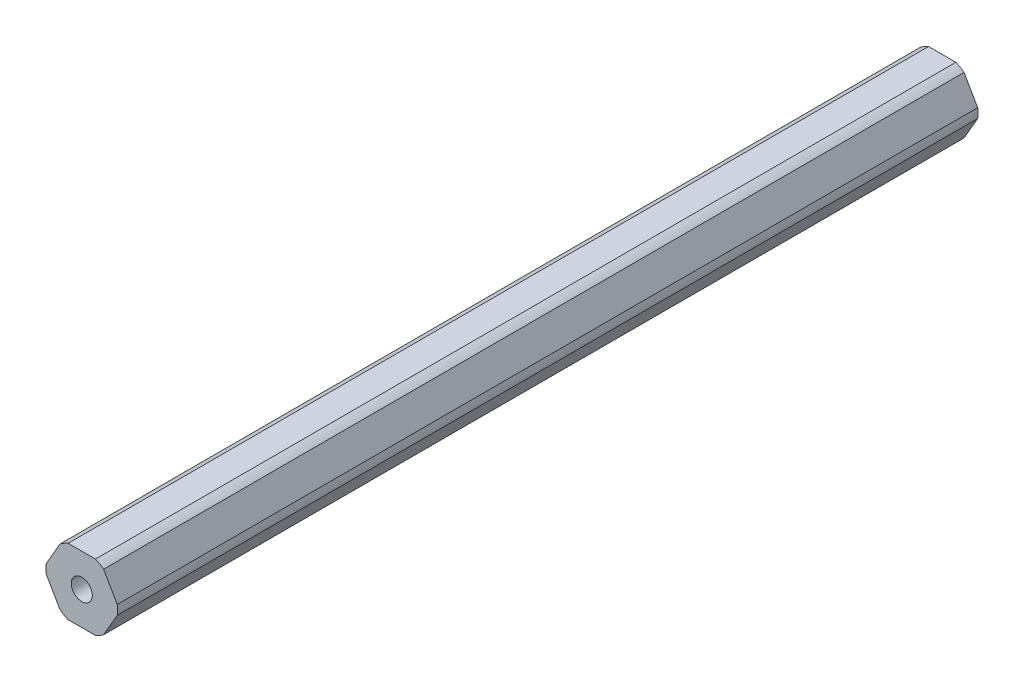
ISO-10303-21;
HEADER;
FILE_DESCRIPTION(('STEP AP214'),'2;1');
FILE_NAME('part.step','',(''),(''),'','','');
FILE_SCHEMA(('AUTOMOTIVE_DESIGN { 1 0 10303 214 1 1 1 1 }'));
ENDSEC;
DATA;
#1=APPLICATION_CONTEXT('core data for automotive mechanical design processes');
#2=APPLICATION_PROTOCOL_DEFINITION('international standard','automotive_design',2000,#1);
#3=PRODUCT_CONTEXT('',#1,'mechanical');
#4=PRODUCT('Part','Part','',(#3));
#5=PRODUCT_RELATED_PRODUCT_CATEGORY('part','',(#4));
#6=PRODUCT_DEFINITION_FORMATION('','',#4);
#7=PRODUCT_DEFINITION_CONTEXT('part definition',#1,'design');
#8=PRODUCT_DEFINITION('design','',#6,#7);
#9=PRODUCT_DEFINITION_SHAPE('','',#8);
#10=(LENGTH_UNIT() NAMED_UNIT(*) SI_UNIT(.MILLI.,.METRE.));
#11=(NAMED_UNIT(*) PLANE_ANGLE_UNIT() SI_UNIT($,.RADIAN.));
#12=(NAMED_UNIT(*) SI_UNIT($,.STERADIAN.) SOLID_ANGLE_UNIT());
#13=UNCERTAINTY_MEASURE_WITH_UNIT(LENGTH_MEASURE(1.E-05),#10,'distance_accuracy_value','');
#14=(GEOMETRIC_REPRESENTATION_CONTEXT(3) GLOBAL_UNCERTAINTY_ASSIGNED_CONTEXT((#13)) GLOBAL_UNIT_ASSIGNED_CONTEXT((#10,
#11,#12)) REPRESENTATION_CONTEXT('',''));
#15=CARTESIAN_POINT('',(0.,0.,0.));
#16=DIRECTION('',(0.,0.,1.));
#17=DIRECTION('',(1.,0.,0.));
#18=AXIS2_PLACEMENT_3D('',#15,#16,#17);
#19=CARTESIAN_POINT('',(-5.49926131403119,3.175,165.1));
#20=DIRECTION('',(0.866025403784438,-0.5,0.));
#21=DIRECTION('',(0.5,0.866025403784439,0.));
#22=AXIS2_PLACEMENT_3D('',#19,#20,#21);
#23=PLANE('',#22);
#24=DIRECTION('',(-0.5,-0.866025403784439,0.));
#25=VECTOR('',#24,1.);
#26=CARTESIAN_POINT('',(-5.49926131403119,3.175,0.));
#27=LINE('',#26,#25);
#28=CARTESIAN_POINT('',(-4.18739065634423,5.4472266320726,0.));
#29=VERTEX_POINT('',#28);
#30=CARTESIAN_POINT('',(-6.81113197171814,0.902773367927401,0.));
#31=VERTEX_POINT('',#30);
#32=EDGE_CURVE('E176',#29,#31,#27,.T.);
#33=ORIENTED_EDGE('',*,*,#32,.T.);
#34=DIRECTION('',(0.,0.,-1.));
#35=VECTOR('',#34,1.);
#36=CARTESIAN_POINT('',(-6.81113197171814,0.902773367927401,165.1));
#37=LINE('',#36,#35);
#38=CARTESIAN_POINT('',(-6.81113197171814,0.902773367927401,165.1));
#39=VERTEX_POINT('',#38);
#40=EDGE_CURVE('E11',#39,#31,#37,.T.);
#41=ORIENTED_EDGE('',*,*,#40,.F.);
#42=DIRECTION('',(-0.5,-0.866025403784439,0.));
#43=VECTOR('',#42,1.);
#44=CARTESIAN_POINT('',(-5.49926131403119,3.175,165.1));
#45=LINE('',#44,#43);
#46=CARTESIAN_POINT('',(-4.18739065634423,5.4472266320726,165.1));
#47=VERTEX_POINT('',#46);
#48=EDGE_CURVE('E290',#47,#39,#45,.T.);
#49=ORIENTED_EDGE('',*,*,#48,.F.);
#50=DIRECTION('',(0.,0.,-1.));
#51=VECTOR('',#50,1.);
#52=CARTESIAN_POINT('',(-4.18739065634423,5.4472266320726,165.1));
#53=LINE('',#52,#51);
#54=EDGE_CURVE('E168',#47,#29,#53,.T.);
#55=ORIENTED_EDGE('',*,*,#54,.T.);
#56=EDGE_LOOP('',(#33,#41,#49,#55));
#57=FACE_BOUND('',#56,.T.);
#58=ADVANCED_FACE('F45',(#57),#23,.F.);
#59=CARTESIAN_POINT('',(0.,0.,165.1));
#60=DIRECTION('',(0.,0.,-1.));
#61=DIRECTION('',(-1.,0.,0.));
#62=AXIS2_PLACEMENT_3D('',#59,#60,#61);
#63=CYLINDRICAL_SURFACE('',#62,6.8707);
#64=CARTESIAN_POINT('',(0.,0.,0.));
#65=DIRECTION('',(0.,0.,1.));
#66=DIRECTION('',(1.,0.,0.));
#67=AXIS2_PLACEMENT_3D('',#64,#65,#66);
#68=CIRCLE('',#67,6.8707);
#69=CARTESIAN_POINT('',(-6.81113197171814,-0.902773367927395,0.));
#70=VERTEX_POINT('',#69);
#71=EDGE_CURVE('E180',#31,#70,#68,.T.);
#72=ORIENTED_EDGE('',*,*,#71,.T.);
#73=DIRECTION('',(0.,0.,-1.));
#74=VECTOR('',#73,1.);
#75=CARTESIAN_POINT('',(-6.81113197171814,-0.902773367927395,165.1));
#76=LINE('',#75,#74);
#77=CARTESIAN_POINT('',(-6.81113197171814,-0.902773367927395,165.1));
#78=VERTEX_POINT('',#77);
#79=EDGE_CURVE('E55',#78,#70,#76,.T.);
#80=ORIENTED_EDGE('',*,*,#79,.F.);
#81=CARTESIAN_POINT('',(0.,0.,165.1));
#82=DIRECTION('',(0.,0.,1.));
#83=DIRECTION('',(1.,0.,0.));
#84=AXIS2_PLACEMENT_3D('',#81,#82,#83);
#85=CIRCLE('',#84,6.8707);
#86=EDGE_CURVE('E118',#39,#78,#85,.T.);
#87=ORIENTED_EDGE('',*,*,#86,.F.);
#88=ORIENTED_EDGE('',*,*,#40,.T.);
#89=EDGE_LOOP('',(#72,#80,#87,#88));
#90=FACE_BOUND('',#89,.T.);
#91=ADVANCED_FACE('F299',(#90),#63,.T.);
#92=CARTESIAN_POINT('',(-5.49926131403119,-3.175,165.1));
#93=DIRECTION('',(0.866025403784439,0.5,0.));
#94=DIRECTION('',(-0.5,0.866025403784439,0.));
#95=AXIS2_PLACEMENT_3D('',#92,#93,#94);
#96=PLANE('',#95);
#97=DIRECTION('',(0.5,-0.866025403784439,0.));
#98=VECTOR('',#97,1.);
#99=CARTESIAN_POINT('',(-5.49926131403119,-3.175,0.));
#100=LINE('',#99,#98);
#101=CARTESIAN_POINT('',(-4.18739065634423,-5.4472266320726,0.));
#102=VERTEX_POINT('',#101);
#103=EDGE_CURVE('E183',#70,#102,#100,.T.);
#104=ORIENTED_EDGE('',*,*,#103,.T.);
#105=DIRECTION('',(0.,0.,-1.));
#106=VECTOR('',#105,1.);
#107=CARTESIAN_POINT('',(-4.18739065634423,-5.4472266320726,165.1));
#108=LINE('',#107,#106);
#109=CARTESIAN_POINT('',(-4.18739065634423,-5.4472266320726,165.1));
#110=VERTEX_POINT('',#109);
#111=EDGE_CURVE('E235',#110,#102,#108,.T.);
#112=ORIENTED_EDGE('',*,*,#111,.F.);
#113=DIRECTION('',(0.5,-0.866025403784439,0.));
#114=VECTOR('',#113,1.);
#115=CARTESIAN_POINT('',(-5.49926131403119,-3.175,165.1));
#116=LINE('',#115,#114);
#117=EDGE_CURVE('E245',#78,#110,#116,.T.);
#118=ORIENTED_EDGE('',*,*,#117,.F.);
#119=ORIENTED_EDGE('',*,*,#79,.T.);
#120=EDGE_LOOP('',(#104,#112,#118,#119));
#121=FACE_BOUND('',#120,.T.);
#122=ADVANCED_FACE('F243',(#121),#96,.F.);
#123=CARTESIAN_POINT('',(0.,0.,165.1));
#124=DIRECTION('',(0.,0.,-1.));
#125=DIRECTION('',(-1.,0.,0.));
#126=AXIS2_PLACEMENT_3D('',#123,#124,#125);
#127=CYLINDRICAL_SURFACE('',#126,6.8707);
#128=CARTESIAN_POINT('',(0.,0.,0.));
#129=DIRECTION('',(0.,0.,1.));
#130=DIRECTION('',(1.,0.,0.));
#131=AXIS2_PLACEMENT_3D('',#128,#129,#130);
#132=CIRCLE('',#131,6.8707);
#133=CARTESIAN_POINT('',(-2.62374131537391,-6.35,0.));
#134=VERTEX_POINT('',#133);
#135=EDGE_CURVE('E186',#102,#134,#132,.T.);
#136=ORIENTED_EDGE('',*,*,#135,.T.);
#137=DIRECTION('',(0.,0.,-1.));
#138=VECTOR('',#137,1.);
#139=CARTESIAN_POINT('',(-2.62374131537391,-6.35,165.1));
#140=LINE('',#139,#138);
#141=CARTESIAN_POINT('',(-2.62374131537391,-6.35,165.1));
#142=VERTEX_POINT('',#141);
#143=EDGE_CURVE('E231',#142,#134,#140,.T.);
#144=ORIENTED_EDGE('',*,*,#143,.F.);
#145=CARTESIAN_POINT('',(0.,0.,165.1));
#146=DIRECTION('',(0.,0.,1.));
#147=DIRECTION('',(1.,0.,0.));
#148=AXIS2_PLACEMENT_3D('',#145,#146,#147);
#149=CIRCLE('',#148,6.8707);
#150=EDGE_CURVE('E264',#110,#142,#149,.T.);
#151=ORIENTED_EDGE('',*,*,#150,.F.);
#152=ORIENTED_EDGE('',*,*,#111,.T.);
#153=EDGE_LOOP('',(#136,#144,#151,#152));
#154=FACE_BOUND('',#153,.T.);
#155=ADVANCED_FACE('F254',(#154),#127,.T.);
#156=CARTESIAN_POINT('',(0.,-6.35,165.1));
#157=DIRECTION('',(0.,1.,0.));
#158=DIRECTION('',(0.,0.,1.));
#159=AXIS2_PLACEMENT_3D('',#156,#157,#158);
#160=PLANE('',#159);
#161=DIRECTION('',(1.,0.,0.));
#162=VECTOR('',#161,1.);
#163=CARTESIAN_POINT('',(0.,-6.35,0.));
#164=LINE('',#163,#162);
#165=CARTESIAN_POINT('',(2.62374131537391,-6.35,0.));
#166=VERTEX_POINT('',#165);
#167=EDGE_CURVE('E189',#134,#166,#164,.T.);
#168=ORIENTED_EDGE('',*,*,#167,.T.);
#169=DIRECTION('',(0.,0.,-1.));
#170=VECTOR('',#169,1.);
#171=CARTESIAN_POINT('',(2.62374131537391,-6.35,165.1));
#172=LINE('',#171,#170);
#173=CARTESIAN_POINT('',(2.62374131537391,-6.35,165.1));
#174=VERTEX_POINT('',#173);
#175=EDGE_CURVE('E227',#174,#166,#172,.T.);
#176=ORIENTED_EDGE('',*,*,#175,.F.);
#177=DIRECTION('',(1.,0.,0.));
#178=VECTOR('',#177,1.);
#179=CARTESIAN_POINT('',(0.,-6.35,165.1));
#180=LINE('',#179,#178);
#181=EDGE_CURVE('E260',#142,#174,#180,.T.);
#182=ORIENTED_EDGE('',*,*,#181,.F.);
#183=ORIENTED_EDGE('',*,*,#143,.T.);
#184=EDGE_LOOP('',(#168,#176,#182,#183));
#185=FACE_BOUND('',#184,.T.);
#186=ADVANCED_FACE('F258',(#185),#160,.F.);
#187=CARTESIAN_POINT('',(0.,0.,165.1));
#188=DIRECTION('',(0.,0.,-1.));
#189=DIRECTION('',(-1.,0.,0.));
#190=AXIS2_PLACEMENT_3D('',#187,#188,#189);
#191=CYLINDRICAL_SURFACE('',#190,6.8707);
#192=CARTESIAN_POINT('',(0.,0.,0.));
#193=DIRECTION('',(0.,0.,1.));
#194=DIRECTION('',(1.,0.,0.));
#195=AXIS2_PLACEMENT_3D('',#192,#193,#194);
#196=CIRCLE('',#195,6.8707);
#197=CARTESIAN_POINT('',(4.18739065634422,-5.44722663207261,0.));
#198=VERTEX_POINT('',#197);
#199=EDGE_CURVE('E192',#166,#198,#196,.T.);
#200=ORIENTED_EDGE('',*,*,#199,.T.);
#201=DIRECTION('',(0.,0.,-1.));
#202=VECTOR('',#201,1.);
#203=CARTESIAN_POINT('',(4.18739065634422,-5.44722663207261,165.1));
#204=LINE('',#203,#202);
#205=CARTESIAN_POINT('',(4.18739065634422,-5.44722663207261,165.1));
#206=VERTEX_POINT('',#205);
#207=EDGE_CURVE('E223',#206,#198,#204,.T.);
#208=ORIENTED_EDGE('',*,*,#207,.F.);
#209=CARTESIAN_POINT('',(0.,0.,165.1));
#210=DIRECTION('',(0.,0.,1.));
#211=DIRECTION('',(1.,0.,0.));
#212=AXIS2_PLACEMENT_3D('',#209,#210,#211);
#213=CIRCLE('',#212,6.8707);
#214=EDGE_CURVE('E263',#174,#206,#213,.T.);
#215=ORIENTED_EDGE('',*,*,#214,.F.);
#216=ORIENTED_EDGE('',*,*,#175,.T.);
#217=EDGE_LOOP('',(#200,#208,#215,#216));
#218=FACE_BOUND('',#217,.T.);
#219=ADVANCED_FACE('F312',(#218),#191,.T.);
#220=CARTESIAN_POINT('',(5.49926131403118,-3.175,165.1));
#221=DIRECTION('',(-0.866025403784439,0.5,0.));
#222=DIRECTION('',(-0.5,-0.866025403784439,0.));
#223=AXIS2_PLACEMENT_3D('',#220,#221,#222);
#224=PLANE('',#223);
#225=DIRECTION('',(0.5,0.866025403784439,0.));
#226=VECTOR('',#225,1.);
#227=CARTESIAN_POINT('',(5.49926131403118,-3.175,0.));
#228=LINE('',#227,#226);
#229=CARTESIAN_POINT('',(6.81113197171814,-0.902773367927386,0.));
#230=VERTEX_POINT('',#229);
#231=EDGE_CURVE('E195',#198,#230,#228,.T.);
#232=ORIENTED_EDGE('',*,*,#231,.T.);
#233=DIRECTION('',(0.,0.,-1.));
#234=VECTOR('',#233,1.);
#235=CARTESIAN_POINT('',(6.81113197171814,-0.902773367927386,165.1));
#236=LINE('',#235,#234);
#237=CARTESIAN_POINT('',(6.81113197171814,-0.902773367927386,165.1));
#238=VERTEX_POINT('',#237);
#239=EDGE_CURVE('E219',#238,#230,#236,.T.);
#240=ORIENTED_EDGE('',*,*,#239,.F.);
#241=DIRECTION('',(0.5,0.866025403784439,0.));
#242=VECTOR('',#241,1.);
#243=CARTESIAN_POINT('',(5.49926131403118,-3.175,165.1));
#244=LINE('',#243,#242);
#245=EDGE_CURVE('E268',#206,#238,#244,.T.);
#246=ORIENTED_EDGE('',*,*,#245,.F.);
#247=ORIENTED_EDGE('',*,*,#207,.T.);
#248=EDGE_LOOP('',(#232,#240,#246,#247));
#249=FACE_BOUND('',#248,.T.);
#250=ADVANCED_FACE('F315',(#249),#224,.F.);
#251=CARTESIAN_POINT('',(0.,0.,165.1));
#252=DIRECTION('',(0.,0.,-1.));
#253=DIRECTION('',(-1.,0.,0.));
#254=AXIS2_PLACEMENT_3D('',#251,#252,#253);
#255=CYLINDRICAL_SURFACE('',#254,6.8707);
#256=CARTESIAN_POINT('',(0.,0.,0.));
#257=DIRECTION('',(0.,0.,1.));
#258=DIRECTION('',(1.,0.,0.));
#259=AXIS2_PLACEMENT_3D('',#256,#257,#258);
#260=CIRCLE('',#259,6.8707);
#261=CARTESIAN_POINT('',(6.81113197171814,0.902773367927401,0.));
#262=VERTEX_POINT('',#261);
#263=EDGE_CURVE('E198',#230,#262,#260,.T.);
#264=ORIENTED_EDGE('',*,*,#263,.T.);
#265=DIRECTION('',(0.,0.,-1.));
#266=VECTOR('',#265,1.);
#267=CARTESIAN_POINT('',(6.81113197171814,0.902773367927401,165.1));
#268=LINE('',#267,#266);
#269=CARTESIAN_POINT('',(6.81113197171814,0.902773367927401,165.1));
#270=VERTEX_POINT('',#269);
#271=EDGE_CURVE('E215',#270,#262,#268,.T.);
#272=ORIENTED_EDGE('',*,*,#271,.F.);
#273=CARTESIAN_POINT('',(0.,0.,165.1));
#274=DIRECTION('',(0.,0.,1.));
#275=DIRECTION('',(1.,0.,0.));
#276=AXIS2_PLACEMENT_3D('',#273,#274,#275);
#277=CIRCLE('',#276,6.8707);
#278=EDGE_CURVE('E155',#238,#270,#277,.T.);
#279=ORIENTED_EDGE('',*,*,#278,.F.);
#280=ORIENTED_EDGE('',*,*,#239,.T.);
#281=EDGE_LOOP('',(#264,#272,#279,#280));
#282=FACE_BOUND('',#281,.T.);
#283=ADVANCED_FACE('F281',(#282),#255,.T.);
#284=CARTESIAN_POINT('',(5.49926131403119,3.175,165.1));
#285=DIRECTION('',(-0.866025403784438,-0.5,0.));
#286=DIRECTION('',(0.5,-0.866025403784439,0.));
#287=AXIS2_PLACEMENT_3D('',#284,#285,#286);
#288=PLANE('',#287);
#289=DIRECTION('',(-0.5,0.866025403784439,0.));
#290=VECTOR('',#289,1.);
#291=CARTESIAN_POINT('',(5.49926131403119,3.175,0.));
#292=LINE('',#291,#290);
#293=CARTESIAN_POINT('',(4.18739065634423,5.4472266320726,0.));
#294=VERTEX_POINT('',#293);
#295=EDGE_CURVE('E201',#262,#294,#292,.T.);
#296=ORIENTED_EDGE('',*,*,#295,.T.);
#297=DIRECTION('',(0.,0.,-1.));
#298=VECTOR('',#297,1.);
#299=CARTESIAN_POINT('',(4.18739065634423,5.4472266320726,165.1));
#300=LINE('',#299,#298);
#301=CARTESIAN_POINT('',(4.18739065634423,5.4472266320726,165.1));
#302=VERTEX_POINT('',#301);
#303=EDGE_CURVE('E161',#302,#294,#300,.T.);
#304=ORIENTED_EDGE('',*,*,#303,.F.);
#305=DIRECTION('',(-0.5,0.866025403784439,0.));
#306=VECTOR('',#305,1.);
#307=CARTESIAN_POINT('',(5.49926131403119,3.175,165.1));
#308=LINE('',#307,#306);
#309=EDGE_CURVE('E149',#270,#302,#308,.T.);
#310=ORIENTED_EDGE('',*,*,#309,.F.);
#311=ORIENTED_EDGE('',*,*,#271,.T.);
#312=EDGE_LOOP('',(#296,#304,#310,#311));
#313=FACE_BOUND('',#312,.T.);
#314=ADVANCED_FACE('F285',(#313),#288,.F.);
#315=CARTESIAN_POINT('',(2.62374131537391,6.35,0.));
#316=VERTEX_POINT('',#315);
#317=EDGE_CURVE('E159',#294,#316,#260,.T.);
#318=ORIENTED_EDGE('',*,*,#317,.T.);
#319=DIRECTION('',(0.,0.,-1.));
#320=VECTOR('',#319,1.);
#321=CARTESIAN_POINT('',(2.62374131537391,6.35,165.1));
#322=LINE('',#321,#320);
#323=CARTESIAN_POINT('',(2.62374131537391,6.35,165.1));
#324=VERTEX_POINT('',#323);
#325=EDGE_CURVE('E156',#324,#316,#322,.T.);
#326=ORIENTED_EDGE('',*,*,#325,.F.);
#327=EDGE_CURVE('E143',#302,#324,#277,.T.);
#328=ORIENTED_EDGE('',*,*,#327,.F.);
#329=ORIENTED_EDGE('',*,*,#303,.T.);
#330=EDGE_LOOP('',(#318,#326,#328,#329));
#331=FACE_BOUND('',#330,.T.);
#332=ADVANCED_FACE('F157',(#331),#255,.T.);
#333=CARTESIAN_POINT('',(0.,6.35,165.1));
#334=DIRECTION('',(0.,-1.,0.));
#335=DIRECTION('',(0.,0.,-1.));
#336=AXIS2_PLACEMENT_3D('',#333,#334,#335);
#337=PLANE('',#336);
#338=DIRECTION('',(-1.,0.,0.));
#339=VECTOR('',#338,1.);
#340=CARTESIAN_POINT('',(0.,6.35,0.));
#341=LINE('',#340,#339);
#342=CARTESIAN_POINT('',(-2.62374131537391,6.35,0.));
#343=VERTEX_POINT('',#342);
#344=EDGE_CURVE('E104',#316,#343,#341,.T.);
#345=ORIENTED_EDGE('',*,*,#344,.T.);
#346=DIRECTION('',(0.,0.,-1.));
#347=VECTOR('',#346,1.);
#348=CARTESIAN_POINT('',(-2.62374131537391,6.35,165.1));
#349=LINE('',#348,#347);
#350=CARTESIAN_POINT('',(-2.62374131537391,6.35,165.1));
#351=VERTEX_POINT('',#350);
#352=EDGE_CURVE('E162',#351,#343,#349,.T.);
#353=ORIENTED_EDGE('',*,*,#352,.F.);
#354=DIRECTION('',(-1.,0.,0.));
#355=VECTOR('',#354,1.);
#356=CARTESIAN_POINT('',(0.,6.35,165.1));
#357=LINE('',#356,#355);
#358=EDGE_CURVE('E147',#324,#351,#357,.T.);
#359=ORIENTED_EDGE('',*,*,#358,.F.);
#360=ORIENTED_EDGE('',*,*,#325,.T.);
#361=EDGE_LOOP('',(#345,#353,#359,#360));
#362=FACE_BOUND('',#361,.T.);
#363=ADVANCED_FACE('F164',(#362),#337,.F.);
#364=CARTESIAN_POINT('',(0.,0.,165.1));
#365=DIRECTION('',(0.,0.,-1.));
#366=DIRECTION('',(-1.,0.,0.));
#367=AXIS2_PLACEMENT_3D('',#364,#365,#366);
#368=CYLINDRICAL_SURFACE('',#367,2.0193);
#369=CARTESIAN_POINT('',(0.,0.,165.1));
#370=DIRECTION('',(0.,0.,1.));
#371=DIRECTION('',(1.,0.,0.));
#372=AXIS2_PLACEMENT_3D('',#369,#370,#371);
#373=CIRCLE('',#372,2.0193);
#374=CARTESIAN_POINT('',(2.0193,0.,165.1));
#375=VERTEX_POINT('',#374);
#376=EDGE_CURVE('E208',#375,#375,#373,.T.);
#377=ORIENTED_EDGE('',*,*,#376,.T.);
#378=EDGE_LOOP('',(#377));
#379=FACE_BOUND('',#378,.T.);
#380=CARTESIAN_POINT('',(0.,0.,0.));
#381=DIRECTION('',(0.,0.,1.));
#382=DIRECTION('',(1.,0.,0.));
#383=AXIS2_PLACEMENT_3D('',#380,#381,#382);
#384=CIRCLE('',#383,2.0193);
#385=CARTESIAN_POINT('',(2.0193,0.,0.));
#386=VERTEX_POINT('',#385);
#387=EDGE_CURVE('E172',#386,#386,#384,.T.);
#388=ORIENTED_EDGE('',*,*,#387,.F.);
#389=EDGE_LOOP('',(#388));
#390=FACE_BOUND('',#389,.T.);
#391=ADVANCED_FACE('F47',(#379,#390),#368,.F.);
#392=CARTESIAN_POINT('',(0.,0.,165.1));
#393=DIRECTION('',(0.,0.,-1.));
#394=DIRECTION('',(-1.,0.,0.));
#395=AXIS2_PLACEMENT_3D('',#392,#393,#394);
#396=CYLINDRICAL_SURFACE('',#395,6.8707);
#397=CARTESIAN_POINT('',(0.,0.,0.));
#398=DIRECTION('',(0.,0.,1.));
#399=DIRECTION('',(1.,0.,0.));
#400=AXIS2_PLACEMENT_3D('',#397,#398,#399);
#401=CIRCLE('',#400,6.8707);
#402=EDGE_CURVE('E110',#343,#29,#401,.T.);
#403=ORIENTED_EDGE('',*,*,#402,.T.);
#404=ORIENTED_EDGE('',*,*,#54,.F.);
#405=CARTESIAN_POINT('',(0.,0.,165.1));
#406=DIRECTION('',(0.,0.,1.));
#407=DIRECTION('',(1.,0.,0.));
#408=AXIS2_PLACEMENT_3D('',#405,#406,#407);
#409=CIRCLE('',#408,6.8707);
#410=EDGE_CURVE('E63',#351,#47,#409,.T.);
#411=ORIENTED_EDGE('',*,*,#410,.F.);
#412=ORIENTED_EDGE('',*,*,#352,.T.);
#413=EDGE_LOOP('',(#403,#404,#411,#412));
#414=FACE_BOUND('',#413,.T.);
#415=ADVANCED_FACE('F326',(#414),#396,.T.);
#416=CARTESIAN_POINT('',(0.,0.,165.1));
#417=DIRECTION('',(0.,0.,1.));
#418=DIRECTION('',(1.,0.,0.));
#419=AXIS2_PLACEMENT_3D('',#416,#417,#418);
#420=PLANE('',#419);
#421=ORIENTED_EDGE('',*,*,#376,.F.);
#422=EDGE_LOOP('',(#421));
#423=FACE_BOUND('',#422,.T.);
#424=ORIENTED_EDGE('',*,*,#48,.T.);
#425=ORIENTED_EDGE('',*,*,#86,.T.);
#426=ORIENTED_EDGE('',*,*,#117,.T.);
#427=ORIENTED_EDGE('',*,*,#150,.T.);
#428=ORIENTED_EDGE('',*,*,#181,.T.);
#429=ORIENTED_EDGE('',*,*,#214,.T.);
#430=ORIENTED_EDGE('',*,*,#245,.T.);
#431=ORIENTED_EDGE('',*,*,#278,.T.);
#432=ORIENTED_EDGE('',*,*,#309,.T.);
#433=ORIENTED_EDGE('',*,*,#327,.T.);
#434=ORIENTED_EDGE('',*,*,#358,.T.);
#435=ORIENTED_EDGE('',*,*,#410,.T.);
#436=EDGE_LOOP('',(#424,#425,#426,#427,#428,#429,#430,#431,#432,#433,#434,#435));
#437=FACE_BOUND('',#436,.T.);
#438=ADVANCED_FACE('F145',(#423,#437),#420,.T.);
#439=CARTESIAN_POINT('',(0.,0.,0.));
#440=DIRECTION('',(0.,0.,1.));
#441=DIRECTION('',(1.,0.,0.));
#442=AXIS2_PLACEMENT_3D('',#439,#440,#441);
#443=PLANE('',#442);
#444=ORIENTED_EDGE('',*,*,#387,.T.);
#445=EDGE_LOOP('',(#444));
#446=FACE_BOUND('',#445,.T.);
#447=ORIENTED_EDGE('',*,*,#32,.F.);
#448=ORIENTED_EDGE('',*,*,#402,.F.);
#449=ORIENTED_EDGE('',*,*,#344,.F.);
#450=ORIENTED_EDGE('',*,*,#317,.F.);
#451=ORIENTED_EDGE('',*,*,#295,.F.);
#452=ORIENTED_EDGE('',*,*,#263,.F.);
#453=ORIENTED_EDGE('',*,*,#231,.F.);
#454=ORIENTED_EDGE('',*,*,#199,.F.);
#455=ORIENTED_EDGE('',*,*,#167,.F.);
#456=ORIENTED_EDGE('',*,*,#135,.F.);
#457=ORIENTED_EDGE('',*,*,#103,.F.);
#458=ORIENTED_EDGE('',*,*,#71,.F.);
#459=EDGE_LOOP('',(#447,#448,#449,#450,#451,#452,#453,#454,#455,#456,#457,#458));
#460=FACE_BOUND('',#459,.T.);
#461=ADVANCED_FACE('F249',(#446,#460),#443,.F.);
#462=CLOSED_SHELL('',(#58,#91,#122,#155,#186,#219,#250,#283,#314,#332,#363,#391,#415,#438,#461));
#463=MANIFOLD_SOLID_BREP('B2',#462);
#464=ADVANCED_BREP_SHAPE_REPRESENTATION('',(#18,#463),#14);
#465=SHAPE_DEFINITION_REPRESENTATION(#9,#464);
ENDSEC;
END-ISO-10303-21;
